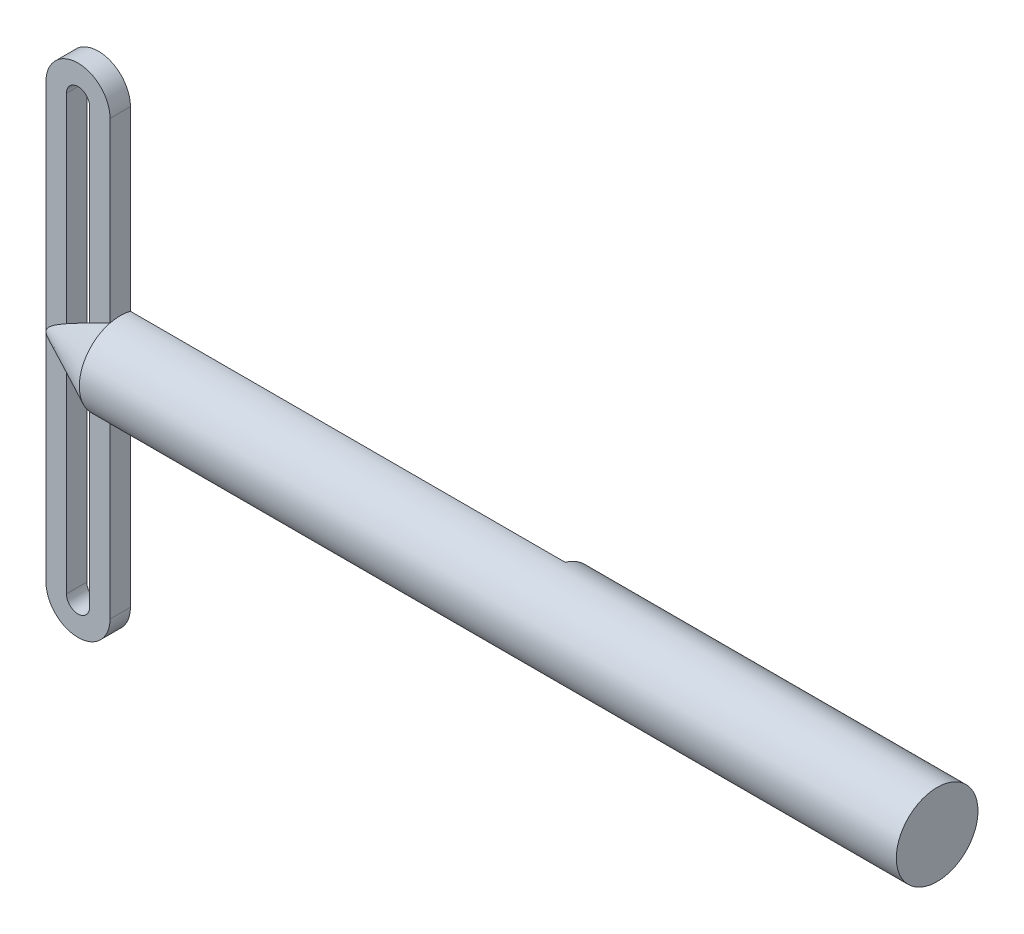
ISO-10303-21;
HEADER;
FILE_DESCRIPTION(('STEP AP214'),'2;1');
FILE_NAME('part.step','',(''),(''),'','','');
FILE_SCHEMA(('AUTOMOTIVE_DESIGN { 1 0 10303 214 1 1 1 1 }'));
ENDSEC;
DATA;
#1=APPLICATION_CONTEXT('core data for automotive mechanical design processes');
#2=APPLICATION_PROTOCOL_DEFINITION('international standard','automotive_design',2000,#1);
#3=PRODUCT_CONTEXT('',#1,'mechanical');
#4=PRODUCT('Part','Part','',(#3));
#5=PRODUCT_RELATED_PRODUCT_CATEGORY('part','',(#4));
#6=PRODUCT_DEFINITION_FORMATION('','',#4);
#7=PRODUCT_DEFINITION_CONTEXT('part definition',#1,'design');
#8=PRODUCT_DEFINITION('design','',#6,#7);
#9=PRODUCT_DEFINITION_SHAPE('','',#8);
#10=(LENGTH_UNIT() NAMED_UNIT(*) SI_UNIT(.MILLI.,.METRE.));
#11=(NAMED_UNIT(*) PLANE_ANGLE_UNIT() SI_UNIT($,.RADIAN.));
#12=(NAMED_UNIT(*) SI_UNIT($,.STERADIAN.) SOLID_ANGLE_UNIT());
#13=UNCERTAINTY_MEASURE_WITH_UNIT(LENGTH_MEASURE(1.E-05),#10,'distance_accuracy_value','');
#14=(GEOMETRIC_REPRESENTATION_CONTEXT(3) GLOBAL_UNCERTAINTY_ASSIGNED_CONTEXT((#13)) GLOBAL_UNIT_ASSIGNED_CONTEXT((#10,
#11,#12)) REPRESENTATION_CONTEXT('',''));
#15=CARTESIAN_POINT('',(0.,0.,0.));
#16=DIRECTION('',(0.,0.,1.));
#17=DIRECTION('',(1.,0.,0.));
#18=AXIS2_PLACEMENT_3D('',#15,#16,#17);
#19=CARTESIAN_POINT('',(0.,67.400163523,3.175));
#20=DIRECTION('',(0.,0.,1.));
#21=DIRECTION('',(1.,0.,0.));
#22=AXIS2_PLACEMENT_3D('',#19,#20,#21);
#23=PLANE('',#22);
#24=DIRECTION('',(0.,1.,0.));
#25=VECTOR('',#24,1.);
#26=CARTESIAN_POINT('',(9.951639355,67.400163523,3.175));
#27=LINE('',#26,#25);
#28=CARTESIAN_POINT('',(9.951639355,-67.400163523,3.175));
#29=VERTEX_POINT('',#28);
#30=CARTESIAN_POINT('',(9.95163935499999,-12.2967221242085,3.175));
#31=VERTEX_POINT('',#30);
#32=EDGE_CURVE('E253',#29,#31,#27,.T.);
#33=ORIENTED_EDGE('',*,*,#32,.T.);
#34=DIRECTION('',(1.,0.,0.));
#35=VECTOR('',#34,1.);
#36=CARTESIAN_POINT('',(-36.3251701197649,-12.2967221242086,3.175));
#37=LINE('',#36,#35);
#38=CARTESIAN_POINT('',(9.92856923282215,-12.2967221242086,3.175));
#39=VERTEX_POINT('',#38);
#40=EDGE_CURVE('E175',#39,#31,#37,.T.);
#41=ORIENTED_EDGE('',*,*,#40,.F.);
#42=CARTESIAN_POINT('',(9.92856923282215,-12.2967221242086,3.175));
#43=CARTESIAN_POINT('',(9.40021267329186,-12.0352635261606,3.175));
#44=CARTESIAN_POINT('',(8.87205462615573,-11.7734028603276,3.175));
#45=CARTESIAN_POINT('',(7.81624960187213,-11.248661261627,3.175));
#46=CARTESIAN_POINT('',(7.28860262171317,-10.9857803348176,3.175));
#47=CARTESIAN_POINT('',(6.23392632847116,-10.4587783977464,3.175));
#48=CARTESIAN_POINT('',(5.70689701677337,-10.1946573847101,3.175));
#49=CARTESIAN_POINT('',(4.65362985695553,-9.66483456339225,3.175));
#50=CARTESIAN_POINT('',(4.12739201357332,-9.39913274569466,3.175));
#51=CARTESIAN_POINT('',(3.60163935499997,-9.13247144941657,3.175));
#52=B_SPLINE_CURVE_WITH_KNOTS('',3,(#42,#43,#44,#45,#46,#47,#48,#49,#50,#51),.UNSPECIFIED.,.F.,
.F.,(4,2,2,2,4),(0.,1.76852838908944,3.53704629287363,5.30556815536591,7.07410056268999),.UNSPECIFIED.);
#53=CARTESIAN_POINT('',(3.601639355,-9.13247144941652,3.175));
#54=VERTEX_POINT('',#53);
#55=EDGE_CURVE('E322',#39,#54,#52,.T.);
#56=ORIENTED_EDGE('',*,*,#55,.T.);
#57=DIRECTION('',(0.,1.,0.));
#58=VECTOR('',#57,1.);
#59=CARTESIAN_POINT('',(3.601639355,67.400163523,3.175));
#60=LINE('',#59,#58);
#61=CARTESIAN_POINT('',(3.601639355,-67.400163523,3.175));
#62=VERTEX_POINT('',#61);
#63=EDGE_CURVE('E209',#62,#54,#60,.T.);
#64=ORIENTED_EDGE('',*,*,#63,.F.);
#65=CARTESIAN_POINT('',(0.,-67.400163523,3.175));
#66=DIRECTION('',(0.,0.,1.));
#67=DIRECTION('',(1.,0.,0.));
#68=AXIS2_PLACEMENT_3D('',#65,#66,#67);
#69=CIRCLE('',#68,3.601639355);
#70=CARTESIAN_POINT('',(-3.60163935499996,-67.400163523,3.175));
#71=VERTEX_POINT('',#70);
#72=EDGE_CURVE('E204',#71,#62,#69,.T.);
#73=ORIENTED_EDGE('',*,*,#72,.F.);
#74=DIRECTION('',(0.,-1.,0.));
#75=VECTOR('',#74,1.);
#76=CARTESIAN_POINT('',(-3.601639355,67.400163523,3.175));
#77=LINE('',#76,#75);
#78=CARTESIAN_POINT('',(-3.601639355,-5.34561174977097,3.175));
#79=VERTEX_POINT('',#78);
#80=EDGE_CURVE('E59',#79,#71,#77,.T.);
#81=ORIENTED_EDGE('',*,*,#80,.F.);
#82=CARTESIAN_POINT('',(-3.601639355,-5.34561174977095,3.175));
#83=CARTESIAN_POINT('',(-3.82669201501389,-5.22016696609639,3.175));
#84=CARTESIAN_POINT('',(-4.05128662577208,-5.09388802547673,3.175));
#85=CARTESIAN_POINT('',(-4.49928147642298,-4.83915140790419,3.175));
#86=CARTESIAN_POINT('',(-4.72268152739645,-4.71069339899715,3.175));
#87=CARTESIAN_POINT('',(-5.16746991312185,-4.45140029709294,3.175));
#88=CARTESIAN_POINT('',(-5.38886149769996,-4.32057079084367,3.175));
#89=CARTESIAN_POINT('',(-5.82962534093046,-4.05557262582838,3.175));
#90=CARTESIAN_POINT('',(-6.04899773284873,-3.92140418962666,3.175));
#91=CARTESIAN_POINT('',(-6.40849446887534,-3.69658398689418,3.175));
#92=CARTESIAN_POINT('',(-6.54940468834875,-3.60718978580888,3.175));
#93=CARTESIAN_POINT('',(-6.82980186236323,-3.42619532732211,3.175));
#94=CARTESIAN_POINT('',(-6.96928883785182,-3.33459510245612,3.175));
#95=CARTESIAN_POINT('',(-7.24681412852673,-3.14847406397823,3.175));
#96=CARTESIAN_POINT('',(-7.38484792293182,-3.0539464900683,3.175));
#97=CARTESIAN_POINT('',(-7.65855764448422,-2.86155741737834,3.175));
#98=CARTESIAN_POINT('',(-7.79423385772066,-2.76369632744292,3.175));
#99=CARTESIAN_POINT('',(-8.05675922606516,-2.5679993955025,3.175));
#100=CARTESIAN_POINT('',(-8.18373854531201,-2.47033899861367,3.175));
#101=CARTESIAN_POINT('',(-8.43375296966406,-2.27010400283209,3.175));
#102=CARTESIAN_POINT('',(-8.55678887223861,-2.16753040812594,3.175));
#103=CARTESIAN_POINT('',(-8.79696417788006,-1.95624657333157,3.175));
#104=CARTESIAN_POINT('',(-8.91411789958859,-1.84755275315074,3.175));
#105=CARTESIAN_POINT('',(-9.14001633079981,-1.62183336182119,3.175));
#106=CARTESIAN_POINT('',(-9.24877129945036,-1.50481830200021,3.175));
#107=CARTESIAN_POINT('',(-9.43138685498455,-1.28560591664424,3.175));
#108=CARTESIAN_POINT('',(-9.50775682533464,-1.18552741743335,3.175));
#109=CARTESIAN_POINT('',(-9.64813434231815,-0.97686619384379,3.175));
#110=CARTESIAN_POINT('',(-9.71215197693904,-0.868290511746388,3.175));
#111=CARTESIAN_POINT('',(-9.80947638683184,-0.666734265250446,3.175));
#112=CARTESIAN_POINT('',(-9.84643905856201,-0.575552605051904,3.175));
#113=CARTESIAN_POINT('',(-9.90498299551209,-0.388457123413757,3.175));
#114=CARTESIAN_POINT('',(-9.92661706698148,-0.292560777155648,3.175));
#115=CARTESIAN_POINT('',(-9.94324191511999,-0.163178203739718,3.175));
#116=CARTESIAN_POINT('',(-9.94638186696771,-0.130642255531356,3.175));
#117=CARTESIAN_POINT('',(-9.95058162815478,-0.0654090102814208,3.175));
#118=CARTESIAN_POINT('',(-9.95163967608958,-0.0327116000580266,3.175));
#119=CARTESIAN_POINT('',(-9.9516393549999,0.,3.175));
#120=B_SPLINE_CURVE_WITH_KNOTS('',3,(#82,#83,#84,#85,#86,#87,#88,#89,#90,#91,#92,#93,#94,#95,
#96,#97,#98,#99,#100,#101,#102,#103,#104,#105,#106,#107,#108,#109,#110,#111,#112,#113,#114,#115,
#116,#117,#118,#119),.UNSPECIFIED.,.F.,.F.,(4,2,2,2,2,2,2,2,2,2,2,2,2,2,2,2,2,2,4),(0.,
0.772966576870776,1.54605198238181,2.31750639152237,3.08890951455086,3.5895161803204,
4.09011546742119,4.59197262408078,5.09376844969529,5.57425268810969,6.05463913807293,
6.53379306822147,7.01235213284782,7.3894420833325,7.766222753768,8.06040791985219,
8.35357463956639,8.4515820391788,8.54967232281827),.UNSPECIFIED.);
#121=CARTESIAN_POINT('',(-9.95163935499998,0.,3.175));
#122=VERTEX_POINT('',#121);
#123=EDGE_CURVE('E330',#79,#122,#120,.T.);
#124=ORIENTED_EDGE('',*,*,#123,.T.);
#125=DIRECTION('',(0.,-1.,0.));
#126=VECTOR('',#125,1.);
#127=CARTESIAN_POINT('',(-9.951639355,67.400163523,3.175));
#128=LINE('',#127,#126);
#129=CARTESIAN_POINT('',(-9.95163935499994,-67.4001635229999,3.175));
#130=VERTEX_POINT('',#129);
#131=EDGE_CURVE('E244',#122,#130,#128,.T.);
#132=ORIENTED_EDGE('',*,*,#131,.T.);
#133=CARTESIAN_POINT('',(0.,-67.400163523,3.175));
#134=DIRECTION('',(0.,0.,1.));
#135=DIRECTION('',(1.,0.,0.));
#136=AXIS2_PLACEMENT_3D('',#133,#134,#135);
#137=CIRCLE('',#136,9.95163935499998);
#138=EDGE_CURVE('E249',#130,#29,#137,.T.);
#139=ORIENTED_EDGE('',*,*,#138,.T.);
#140=EDGE_LOOP('',(#33,#41,#56,#64,#73,#81,#124,#132,#139));
#141=FACE_BOUND('',#140,.T.);
#142=ADVANCED_FACE('F37',(#141),#23,.T.);
#143=CARTESIAN_POINT('',(-9.951639355,67.400163523,3.175));
#144=VERTEX_POINT('',#143);
#145=EDGE_CURVE('E246',#144,#122,#128,.T.);
#146=ORIENTED_EDGE('',*,*,#145,.T.);
#147=CARTESIAN_POINT('',(-9.95163935499998,0.,3.17499999999996));
#148=CARTESIAN_POINT('',(-9.95169448239353,0.0562897077029268,3.17499999999998));
#149=CARTESIAN_POINT('',(-9.9485168782644,0.112541193673862,3.175));
#150=CARTESIAN_POINT('',(-9.93613655770212,0.22422483855214,3.175));
#151=CARTESIAN_POINT('',(-9.92695065613406,0.279658843846916,3.175));
#152=CARTESIAN_POINT('',(-9.90327086467274,0.387998264955036,3.175));
#153=CARTESIAN_POINT('',(-9.88890663074982,0.44093249122138,3.175));
#154=CARTESIAN_POINT('',(-9.85547023727371,0.545315660559682,3.175));
#155=CARTESIAN_POINT('',(-9.83639463535345,0.596763486753073,3.175));
#156=CARTESIAN_POINT('',(-9.78653768012022,0.716333875766968,3.175));
#157=CARTESIAN_POINT('',(-9.75402063679816,0.78373086546049,3.175));
#158=CARTESIAN_POINT('',(-9.68304697399354,0.915299864193731,3.175));
#159=CARTESIAN_POINT('',(-9.64458770488763,0.979470417572486,3.175));
#160=CARTESIAN_POINT('',(-9.56258642078678,1.10545301857098,3.175));
#161=CARTESIAN_POINT('',(-9.51899332397768,1.16723151339738,3.175));
#162=CARTESIAN_POINT('',(-9.42811876761771,1.28796187607611,3.175));
#163=CARTESIAN_POINT('',(-9.380838212226,1.346914431156,3.175));
#164=CARTESIAN_POINT('',(-9.25638608727381,1.49430604622022,3.175));
#165=CARTESIAN_POINT('',(-9.17715634733817,1.58100261329657,3.175));
#166=CARTESIAN_POINT('',(-9.01370950585463,1.74959256881134,3.175));
#167=CARTESIAN_POINT('',(-8.92948923487021,1.83148283766864,3.175));
#168=CARTESIAN_POINT('',(-8.75724236839067,1.99148943500434,3.175));
#169=CARTESIAN_POINT('',(-8.6692084680823,2.06959785369145,3.175));
#170=CARTESIAN_POINT('',(-8.49037708011649,2.22259758983146,3.175));
#171=CARTESIAN_POINT('',(-8.39957909591575,2.29748832335909,3.175));
#172=CARTESIAN_POINT('',(-8.21536876209012,2.44499165159033,3.175));
#173=CARTESIAN_POINT('',(-8.12194511650669,2.51759008643868,3.175));
#174=CARTESIAN_POINT('',(-7.9333891386111,2.66053778568369,3.175));
#175=CARTESIAN_POINT('',(-7.83825668953733,2.73088689546512,3.175));
#176=CARTESIAN_POINT('',(-7.55107354014842,2.93891756136008,3.175));
#177=CARTESIAN_POINT('',(-7.35698235857416,3.0737826520781,3.175));
#178=CARTESIAN_POINT('',(-7.01559064201126,3.30397313731916,3.175));
#179=CARTESIAN_POINT('',(-6.8691144503241,3.40053564897337,3.175));
#180=CARTESIAN_POINT('',(-6.57455318409859,3.591184250259,3.175));
#181=CARTESIAN_POINT('',(-6.42646806217799,3.68527026667797,3.175));
#182=CARTESIAN_POINT('',(-5.98014265196966,3.9646045208739,3.175));
#183=CARTESIAN_POINT('',(-5.68000372791445,4.14681508863309,3.175));
#184=CARTESIAN_POINT('',(-5.08455846215241,4.50067403467468,3.175));
#185=CARTESIAN_POINT('',(-4.789342066533,4.67247485972521,3.175));
#186=CARTESIAN_POINT('',(-4.34494266510378,4.92707982104348,3.175));
#187=CARTESIAN_POINT('',(-4.19662046560182,5.01139135151681,3.175));
#188=CARTESIAN_POINT('',(-3.89948226560669,5.17913221151051,3.175));
#189=CARTESIAN_POINT('',(-3.7506662762341,5.26256156072356,3.175));
#190=CARTESIAN_POINT('',(-3.60163935499999,5.34561174977097,3.175));
#191=B_SPLINE_CURVE_WITH_KNOTS('',3,(#147,#148,#149,#150,#151,#152,#153,#154,#155,#156,#157,
#158,#159,#160,#161,#162,#163,#164,#165,#166,#167,#168,#169,#170,#171,#172,#173,#174,#175,#176,
#177,#178,#179,#180,#181,#182,#183,#184,#185,#186,#187,#188,#189,#190),.UNSPECIFIED.,.F.,.F.,(4,
2,2,2,2,2,2,2,2,2,2,2,2,2,2,2,2,2,2,2,2,4),(0.,0.168718617034621,0.336967065666885,
0.501266209773684,0.665685756244204,0.889783823701974,1.1139821058399,1.34063732131816,
1.56723713496434,1.91927537358042,2.2715396355902,2.62451137579148,2.97754690284159,
3.33245145376667,3.6873803480795,4.39626707113989,4.92256912205009,5.44888671455263,
6.50213901563629,7.52680364456953,8.03863228465319,8.55044947511146),.UNSPECIFIED.);
#192=CARTESIAN_POINT('',(-3.601639355,5.34561174977097,3.175));
#193=VERTEX_POINT('',#192);
#194=EDGE_CURVE('E52',#122,#193,#191,.T.);
#195=ORIENTED_EDGE('',*,*,#194,.T.);
#196=CARTESIAN_POINT('',(-3.601639355,67.400163523,3.175));
#197=VERTEX_POINT('',#196);
#198=EDGE_CURVE('E67',#197,#193,#77,.T.);
#199=ORIENTED_EDGE('',*,*,#198,.F.);
#200=CARTESIAN_POINT('',(0.,67.400163523,3.175));
#201=DIRECTION('',(0.,0.,1.));
#202=DIRECTION('',(1.,0.,0.));
#203=AXIS2_PLACEMENT_3D('',#200,#201,#202);
#204=CIRCLE('',#203,3.601639355);
#205=CARTESIAN_POINT('',(3.601639355,67.400163523,3.175));
#206=VERTEX_POINT('',#205);
#207=EDGE_CURVE('E198',#206,#197,#204,.T.);
#208=ORIENTED_EDGE('',*,*,#207,.F.);
#209=CARTESIAN_POINT('',(3.601639355,9.13247144941652,3.175));
#210=VERTEX_POINT('',#209);
#211=EDGE_CURVE('E208',#210,#206,#60,.T.);
#212=ORIENTED_EDGE('',*,*,#211,.F.);
#213=CARTESIAN_POINT('',(3.601639355,9.13247144941651,3.175));
#214=CARTESIAN_POINT('',(4.12739201357333,9.39913274569463,3.175));
#215=CARTESIAN_POINT('',(4.65362985695553,9.66483456339224,3.175));
#216=CARTESIAN_POINT('',(5.70689701677337,10.1946573847101,3.175));
#217=CARTESIAN_POINT('',(6.23392632847116,10.4587783977464,3.175));
#218=CARTESIAN_POINT('',(7.28860262171317,10.9857803348176,3.175));
#219=CARTESIAN_POINT('',(7.81624960187213,11.248661261627,3.175));
#220=CARTESIAN_POINT('',(8.87205462615573,11.7734028603276,3.175));
#221=CARTESIAN_POINT('',(9.40021267329185,12.0352635261607,3.175));
#222=CARTESIAN_POINT('',(9.92856923282214,12.2967221242086,3.175));
#223=B_SPLINE_CURVE_WITH_KNOTS('',3,(#213,#214,#215,#216,#217,#218,#219,#220,#221,#222),
.UNSPECIFIED.,.F.,.F.,(4,2,2,2,4),(0.,1.76853240732408,3.53705426981637,5.30557217360056,
7.07410056268999),.UNSPECIFIED.);
#224=CARTESIAN_POINT('',(9.92856923282215,12.2967221242085,3.175));
#225=VERTEX_POINT('',#224);
#226=EDGE_CURVE('E11',#210,#225,#223,.T.);
#227=ORIENTED_EDGE('',*,*,#226,.T.);
#228=DIRECTION('',(1.,0.,0.));
#229=VECTOR('',#228,1.);
#230=CARTESIAN_POINT('',(-36.3251701197649,12.2967221242085,3.175));
#231=LINE('',#230,#229);
#232=CARTESIAN_POINT('',(9.951639355,12.2967221242085,3.175));
#233=VERTEX_POINT('',#232);
#234=EDGE_CURVE('E178',#225,#233,#231,.T.);
#235=ORIENTED_EDGE('',*,*,#234,.T.);
#236=CARTESIAN_POINT('',(9.951639355,67.400163523,3.175));
#237=VERTEX_POINT('',#236);
#238=EDGE_CURVE('E252',#233,#237,#27,.T.);
#239=ORIENTED_EDGE('',*,*,#238,.T.);
#240=CARTESIAN_POINT('',(0.,67.400163523,3.175));
#241=DIRECTION('',(0.,0.,1.));
#242=DIRECTION('',(1.,0.,0.));
#243=AXIS2_PLACEMENT_3D('',#240,#241,#242);
#244=CIRCLE('',#243,9.951639355);
#245=EDGE_CURVE('E240',#237,#144,#244,.T.);
#246=ORIENTED_EDGE('',*,*,#245,.T.);
#247=EDGE_LOOP('',(#146,#195,#199,#208,#212,#227,#235,#239,#246));
#248=FACE_BOUND('',#247,.T.);
#249=ADVANCED_FACE('F339',(#248),#23,.T.);
#250=CARTESIAN_POINT('',(0.,67.400163523,-3.175));
#251=DIRECTION('',(0.,0.,1.));
#252=DIRECTION('',(1.,0.,0.));
#253=AXIS2_PLACEMENT_3D('',#250,#251,#252);
#254=PLANE('',#253);
#255=DIRECTION('',(0.,1.,0.));
#256=VECTOR('',#255,1.);
#257=CARTESIAN_POINT('',(9.951639355,67.400163523,-3.175));
#258=LINE('',#257,#256);
#259=CARTESIAN_POINT('',(9.95163935499999,12.2967221242086,-3.17499999999999));
#260=VERTEX_POINT('',#259);
#261=CARTESIAN_POINT('',(9.951639355,67.400163523,-3.175));
#262=VERTEX_POINT('',#261);
#263=EDGE_CURVE('E169',#260,#262,#258,.T.);
#264=ORIENTED_EDGE('',*,*,#263,.F.);
#265=DIRECTION('',(-1.,0.,0.));
#266=VECTOR('',#265,1.);
#267=CARTESIAN_POINT('',(263.951639355,12.2967221242086,-3.17499999999999));
#268=LINE('',#267,#266);
#269=CARTESIAN_POINT('',(145.136629866112,12.2967221242086,-3.17499999999998));
#270=VERTEX_POINT('',#269);
#271=EDGE_CURVE('E155',#270,#260,#268,.T.);
#272=ORIENTED_EDGE('',*,*,#271,.F.);
#273=CARTESIAN_POINT('',(-9.95163935499998,0.,-3.17499999999998));
#274=DIRECTION('',(0.,0.,1.));
#275=DIRECTION('',(0.,-1.,0.));
#276=AXIS2_PLACEMENT_3D('',#273,#274,#275);
#277=CIRCLE('',#276,155.575);
#278=CARTESIAN_POINT('',(145.136629866112,-12.2967221242086,-3.17499999999998));
#279=VERTEX_POINT('',#278);
#280=EDGE_CURVE('E167',#279,#270,#277,.T.);
#281=ORIENTED_EDGE('',*,*,#280,.F.);
#282=DIRECTION('',(-1.,0.,0.));
#283=VECTOR('',#282,1.);
#284=CARTESIAN_POINT('',(263.951639355,-12.2967221242086,-3.17499999999999));
#285=LINE('',#284,#283);
#286=CARTESIAN_POINT('',(9.95163935499999,-12.2967221242086,-3.17499999999999));
#287=VERTEX_POINT('',#286);
#288=EDGE_CURVE('E158',#287,#279,#285,.F.);
#289=ORIENTED_EDGE('',*,*,#288,.F.);
#290=CARTESIAN_POINT('',(9.951639355,-67.400163523,-3.175));
#291=VERTEX_POINT('',#290);
#292=EDGE_CURVE('E245',#291,#287,#258,.T.);
#293=ORIENTED_EDGE('',*,*,#292,.F.);
#294=CARTESIAN_POINT('',(0.,-67.400163523,-3.175));
#295=DIRECTION('',(0.,0.,1.));
#296=DIRECTION('',(1.,0.,0.));
#297=AXIS2_PLACEMENT_3D('',#294,#295,#296);
#298=CIRCLE('',#297,9.95163935499998);
#299=CARTESIAN_POINT('',(-9.95163935499994,-67.4001635229999,-3.175));
#300=VERTEX_POINT('',#299);
#301=EDGE_CURVE('E264',#300,#291,#298,.T.);
#302=ORIENTED_EDGE('',*,*,#301,.F.);
#303=DIRECTION('',(0.,-1.,0.));
#304=VECTOR('',#303,1.);
#305=CARTESIAN_POINT('',(-9.951639355,67.400163523,-3.175));
#306=LINE('',#305,#304);
#307=CARTESIAN_POINT('',(-9.951639355,67.400163523,-3.175));
#308=VERTEX_POINT('',#307);
#309=EDGE_CURVE('E261',#308,#300,#306,.T.);
#310=ORIENTED_EDGE('',*,*,#309,.F.);
#311=CARTESIAN_POINT('',(0.,67.400163523,-3.175));
#312=DIRECTION('',(0.,0.,1.));
#313=DIRECTION('',(1.,0.,0.));
#314=AXIS2_PLACEMENT_3D('',#311,#312,#313);
#315=CIRCLE('',#314,9.951639355);
#316=EDGE_CURVE('E239',#262,#308,#315,.T.);
#317=ORIENTED_EDGE('',*,*,#316,.F.);
#318=EDGE_LOOP('',(#264,#272,#281,#289,#293,#302,#310,#317));
#319=FACE_BOUND('',#318,.T.);
#320=DIRECTION('',(0.,-1.,0.));
#321=VECTOR('',#320,1.);
#322=CARTESIAN_POINT('',(-3.601639355,67.400163523,-3.175));
#323=LINE('',#322,#321);
#324=CARTESIAN_POINT('',(-3.601639355,67.400163523,-3.175));
#325=VERTEX_POINT('',#324);
#326=CARTESIAN_POINT('',(-3.60163935499996,-67.400163523,-3.175));
#327=VERTEX_POINT('',#326);
#328=EDGE_CURVE('E216',#325,#327,#323,.T.);
#329=ORIENTED_EDGE('',*,*,#328,.T.);
#330=CARTESIAN_POINT('',(0.,-67.400163523,-3.175));
#331=DIRECTION('',(0.,0.,1.));
#332=DIRECTION('',(1.,0.,0.));
#333=AXIS2_PLACEMENT_3D('',#330,#331,#332);
#334=CIRCLE('',#333,3.601639355);
#335=CARTESIAN_POINT('',(3.601639355,-67.400163523,-3.175));
#336=VERTEX_POINT('',#335);
#337=EDGE_CURVE('E219',#327,#336,#334,.T.);
#338=ORIENTED_EDGE('',*,*,#337,.T.);
#339=DIRECTION('',(0.,1.,0.));
#340=VECTOR('',#339,1.);
#341=CARTESIAN_POINT('',(3.601639355,67.400163523,-3.175));
#342=LINE('',#341,#340);
#343=CARTESIAN_POINT('',(3.601639355,67.400163523,-3.175));
#344=VERTEX_POINT('',#343);
#345=EDGE_CURVE('E201',#336,#344,#342,.T.);
#346=ORIENTED_EDGE('',*,*,#345,.T.);
#347=CARTESIAN_POINT('',(0.,67.400163523,-3.175));
#348=DIRECTION('',(0.,0.,1.));
#349=DIRECTION('',(1.,0.,0.));
#350=AXIS2_PLACEMENT_3D('',#347,#348,#349);
#351=CIRCLE('',#350,3.601639355);
#352=EDGE_CURVE('E195',#344,#325,#351,.T.);
#353=ORIENTED_EDGE('',*,*,#352,.T.);
#354=EDGE_LOOP('',(#329,#338,#346,#353));
#355=FACE_BOUND('',#354,.T.);
#356=ADVANCED_FACE('F165',(#319,#355),#254,.F.);
#357=CARTESIAN_POINT('',(9.951639355,67.400163523,3.175));
#358=DIRECTION('',(-1.,0.,0.));
#359=DIRECTION('',(0.,0.,1.));
#360=AXIS2_PLACEMENT_3D('',#357,#358,#359);
#361=PLANE('',#360);
#362=CARTESIAN_POINT('',(9.95163935499999,0.,0.));
#363=DIRECTION('',(-1.,0.,0.));
#364=DIRECTION('',(0.,0.,1.));
#365=AXIS2_PLACEMENT_3D('',#362,#363,#364);
#366=CIRCLE('',#365,12.7);
#367=EDGE_CURVE('E285',#31,#287,#366,.F.);
#368=ORIENTED_EDGE('',*,*,#367,.F.);
#369=ORIENTED_EDGE('',*,*,#32,.F.);
#370=DIRECTION('',(0.,0.,-1.));
#371=VECTOR('',#370,1.);
#372=CARTESIAN_POINT('',(9.951639355,-67.400163523,3.175));
#373=LINE('',#372,#371);
#374=EDGE_CURVE('E273',#29,#291,#373,.T.);
#375=ORIENTED_EDGE('',*,*,#374,.T.);
#376=ORIENTED_EDGE('',*,*,#292,.T.);
#377=EDGE_LOOP('',(#368,#369,#375,#376));
#378=FACE_BOUND('',#377,.T.);
#379=ADVANCED_FACE('F375',(#378),#361,.F.);
#380=CARTESIAN_POINT('',(0.,67.400163523,3.175));
#381=DIRECTION('',(0.,0.,-1.));
#382=DIRECTION('',(-1.,0.,0.));
#383=AXIS2_PLACEMENT_3D('',#380,#381,#382);
#384=CYLINDRICAL_SURFACE('',#383,9.951639355);
#385=ORIENTED_EDGE('',*,*,#316,.T.);
#386=DIRECTION('',(0.,0.,-1.));
#387=VECTOR('',#386,1.);
#388=CARTESIAN_POINT('',(-9.951639355,67.400163523,3.175));
#389=LINE('',#388,#387);
#390=EDGE_CURVE('E281',#144,#308,#389,.T.);
#391=ORIENTED_EDGE('',*,*,#390,.F.);
#392=ORIENTED_EDGE('',*,*,#245,.F.);
#393=DIRECTION('',(0.,0.,-1.));
#394=VECTOR('',#393,1.);
#395=CARTESIAN_POINT('',(9.951639355,67.400163523,3.175));
#396=LINE('',#395,#394);
#397=EDGE_CURVE('E257',#237,#262,#396,.T.);
#398=ORIENTED_EDGE('',*,*,#397,.T.);
#399=EDGE_LOOP('',(#385,#391,#392,#398));
#400=FACE_BOUND('',#399,.T.);
#401=ADVANCED_FACE('F385',(#400),#384,.T.);
#402=CARTESIAN_POINT('',(-9.951639355,67.400163523,3.175));
#403=DIRECTION('',(1.,0.,0.));
#404=DIRECTION('',(0.,1.,0.));
#405=AXIS2_PLACEMENT_3D('',#402,#403,#404);
#406=PLANE('',#405);
#407=ORIENTED_EDGE('',*,*,#131,.F.);
#408=ORIENTED_EDGE('',*,*,#145,.F.);
#409=ORIENTED_EDGE('',*,*,#390,.T.);
#410=ORIENTED_EDGE('',*,*,#309,.T.);
#411=DIRECTION('',(0.,0.,-1.));
#412=VECTOR('',#411,1.);
#413=CARTESIAN_POINT('',(-9.95163935499994,-67.4001635229999,3.175));
#414=LINE('',#413,#412);
#415=EDGE_CURVE('E277',#130,#300,#414,.T.);
#416=ORIENTED_EDGE('',*,*,#415,.F.);
#417=EDGE_LOOP('',(#407,#408,#409,#410,#416));
#418=FACE_BOUND('',#417,.T.);
#419=ADVANCED_FACE('F381',(#418),#406,.F.);
#420=CARTESIAN_POINT('',(0.,-67.400163523,3.175));
#421=DIRECTION('',(0.,0.,-1.));
#422=DIRECTION('',(-1.,0.,0.));
#423=AXIS2_PLACEMENT_3D('',#420,#421,#422);
#424=CYLINDRICAL_SURFACE('',#423,9.95163935499998);
#425=ORIENTED_EDGE('',*,*,#301,.T.);
#426=ORIENTED_EDGE('',*,*,#374,.F.);
#427=ORIENTED_EDGE('',*,*,#138,.F.);
#428=ORIENTED_EDGE('',*,*,#415,.T.);
#429=EDGE_LOOP('',(#425,#426,#427,#428));
#430=FACE_BOUND('',#429,.T.);
#431=ADVANCED_FACE('F379',(#430),#424,.T.);
#432=CARTESIAN_POINT('',(9.951639355,0.,0.));
#433=DIRECTION('',(1.,0.,0.));
#434=DIRECTION('',(0.,0.,-1.));
#435=AXIS2_PLACEMENT_3D('',#432,#433,#434);
#436=CIRCLE('',#435,12.7);
#437=EDGE_CURVE('E190',#260,#233,#436,.T.);
#438=ORIENTED_EDGE('',*,*,#437,.F.);
#439=ORIENTED_EDGE('',*,*,#263,.T.);
#440=ORIENTED_EDGE('',*,*,#397,.F.);
#441=ORIENTED_EDGE('',*,*,#238,.F.);
#442=EDGE_LOOP('',(#438,#439,#440,#441));
#443=FACE_BOUND('',#442,.T.);
#444=ADVANCED_FACE('F389',(#443),#361,.F.);
#445=CARTESIAN_POINT('',(0.,67.400163523,3.175));
#446=DIRECTION('',(0.,0.,-1.));
#447=DIRECTION('',(-1.,0.,0.));
#448=AXIS2_PLACEMENT_3D('',#445,#446,#447);
#449=CYLINDRICAL_SURFACE('',#448,3.601639355);
#450=ORIENTED_EDGE('',*,*,#352,.F.);
#451=DIRECTION('',(0.,0.,-1.));
#452=VECTOR('',#451,1.);
#453=CARTESIAN_POINT('',(3.601639355,67.400163523,3.175));
#454=LINE('',#453,#452);
#455=EDGE_CURVE('E212',#206,#344,#454,.T.);
#456=ORIENTED_EDGE('',*,*,#455,.F.);
#457=ORIENTED_EDGE('',*,*,#207,.T.);
#458=DIRECTION('',(0.,0.,-1.));
#459=VECTOR('',#458,1.);
#460=CARTESIAN_POINT('',(-3.601639355,67.400163523,3.175));
#461=LINE('',#460,#459);
#462=EDGE_CURVE('E235',#197,#325,#461,.T.);
#463=ORIENTED_EDGE('',*,*,#462,.T.);
#464=EDGE_LOOP('',(#450,#456,#457,#463));
#465=FACE_BOUND('',#464,.T.);
#466=ADVANCED_FACE('F340',(#465),#449,.F.);
#467=CARTESIAN_POINT('',(-3.601639355,67.400163523,3.175));
#468=DIRECTION('',(1.,0.,0.));
#469=DIRECTION('',(0.,0.,-1.));
#470=AXIS2_PLACEMENT_3D('',#467,#468,#469);
#471=PLANE('',#470);
#472=ORIENTED_EDGE('',*,*,#328,.F.);
#473=ORIENTED_EDGE('',*,*,#462,.F.);
#474=ORIENTED_EDGE('',*,*,#198,.T.);
#475=DIRECTION('',(0.,-1.,0.));
#476=VECTOR('',#475,1.);
#477=CARTESIAN_POINT('',(-3.601639355,67.400163523,3.175));
#478=LINE('',#477,#476);
#479=EDGE_CURVE('E187',#193,#79,#478,.T.);
#480=ORIENTED_EDGE('',*,*,#479,.T.);
#481=ORIENTED_EDGE('',*,*,#80,.T.);
#482=DIRECTION('',(0.,0.,-1.));
#483=VECTOR('',#482,1.);
#484=CARTESIAN_POINT('',(-3.60163935499996,-67.400163523,3.175));
#485=LINE('',#484,#483);
#486=EDGE_CURVE('E231',#71,#327,#485,.T.);
#487=ORIENTED_EDGE('',*,*,#486,.T.);
#488=EDGE_LOOP('',(#472,#473,#474,#480,#481,#487));
#489=FACE_BOUND('',#488,.T.);
#490=ADVANCED_FACE('F394',(#489),#471,.T.);
#491=CARTESIAN_POINT('',(0.,-67.400163523,3.175));
#492=DIRECTION('',(0.,0.,-1.));
#493=DIRECTION('',(-1.,0.,0.));
#494=AXIS2_PLACEMENT_3D('',#491,#492,#493);
#495=CYLINDRICAL_SURFACE('',#494,3.601639355);
#496=ORIENTED_EDGE('',*,*,#337,.F.);
#497=ORIENTED_EDGE('',*,*,#486,.F.);
#498=ORIENTED_EDGE('',*,*,#72,.T.);
#499=DIRECTION('',(0.,0.,-1.));
#500=VECTOR('',#499,1.);
#501=CARTESIAN_POINT('',(3.601639355,-67.400163523,3.175));
#502=LINE('',#501,#500);
#503=EDGE_CURVE('E228',#62,#336,#502,.T.);
#504=ORIENTED_EDGE('',*,*,#503,.T.);
#505=EDGE_LOOP('',(#496,#497,#498,#504));
#506=FACE_BOUND('',#505,.T.);
#507=ADVANCED_FACE('F397',(#506),#495,.F.);
#508=CARTESIAN_POINT('',(3.601639355,67.400163523,3.175));
#509=DIRECTION('',(-1.,0.,0.));
#510=DIRECTION('',(0.,0.,1.));
#511=AXIS2_PLACEMENT_3D('',#508,#509,#510);
#512=PLANE('',#511);
#513=ORIENTED_EDGE('',*,*,#345,.F.);
#514=ORIENTED_EDGE('',*,*,#503,.F.);
#515=ORIENTED_EDGE('',*,*,#63,.T.);
#516=DIRECTION('',(0.,1.,0.));
#517=VECTOR('',#516,1.);
#518=CARTESIAN_POINT('',(3.601639355,67.400163523,3.175));
#519=LINE('',#518,#517);
#520=EDGE_CURVE('E183',#54,#210,#519,.T.);
#521=ORIENTED_EDGE('',*,*,#520,.T.);
#522=ORIENTED_EDGE('',*,*,#211,.T.);
#523=ORIENTED_EDGE('',*,*,#455,.T.);
#524=EDGE_LOOP('',(#513,#514,#515,#521,#522,#523));
#525=FACE_BOUND('',#524,.T.);
#526=ADVANCED_FACE('F400',(#525),#512,.T.);
#527=CARTESIAN_POINT('',(263.951639355,0.,0.));
#528=DIRECTION('',(-1.,0.,0.));
#529=DIRECTION('',(0.,0.,1.));
#530=AXIS2_PLACEMENT_3D('',#527,#528,#529);
#531=CYLINDRICAL_SURFACE('',#530,12.7);
#532=CARTESIAN_POINT('',(263.951639355,0.,0.));
#533=DIRECTION('',(1.,0.,0.));
#534=DIRECTION('',(0.,0.,-1.));
#535=AXIS2_PLACEMENT_3D('',#532,#533,#534);
#536=CIRCLE('',#535,12.7);
#537=CARTESIAN_POINT('',(263.951639355,0.,-12.7));
#538=VERTEX_POINT('',#537);
#539=EDGE_CURVE('E191',#538,#538,#536,.T.);
#540=ORIENTED_EDGE('',*,*,#539,.F.);
#541=EDGE_LOOP('',(#540));
#542=FACE_BOUND('',#541,.T.);
#543=ORIENTED_EDGE('',*,*,#234,.F.);
#544=CARTESIAN_POINT('',(9.92856923282215,0.,0.));
#545=DIRECTION('',(1.,0.,0.));
#546=DIRECTION('',(0.,0.,-1.));
#547=AXIS2_PLACEMENT_3D('',#544,#545,#546);
#548=CIRCLE('',#547,12.7);
#549=EDGE_CURVE('E171',#225,#39,#548,.T.);
#550=ORIENTED_EDGE('',*,*,#549,.T.);
#551=ORIENTED_EDGE('',*,*,#40,.T.);
#552=ORIENTED_EDGE('',*,*,#367,.T.);
#553=ORIENTED_EDGE('',*,*,#288,.T.);
#554=CARTESIAN_POINT('',(145.136629866112,-12.2967221242086,-3.17499999999998));
#555=CARTESIAN_POINT('',(145.143700722918,-12.2074553101836,-3.52088294221486));
#556=CARTESIAN_POINT('',(145.151870107227,-12.1035302244786,-3.86295046349283));
#557=CARTESIAN_POINT('',(145.170128431147,-11.8672823680729,-4.5370580893211));
#558=CARTESIAN_POINT('',(145.180217246713,-11.734961432405,-4.86909884025322));
#559=CARTESIAN_POINT('',(145.202029497152,-11.4429417104411,-5.52055013682872));
#560=CARTESIAN_POINT('',(145.213751664285,-11.2832641353853,-5.83997023364029));
#561=CARTESIAN_POINT('',(145.238499613252,-10.9376158244349,-6.46419547605116));
#562=CARTESIAN_POINT('',(145.251525385291,-10.7516452861081,-6.76900073144463));
#563=CARTESIAN_POINT('',(145.278516750048,-10.3546525635221,-7.36196495057499));
#564=CARTESIAN_POINT('',(145.292482710189,-10.1436205603999,-7.65011732369042));
#565=CARTESIAN_POINT('',(145.320953436816,-9.69806017572072,-8.2076159810999));
#566=CARTESIAN_POINT('',(145.335458203943,-9.4635317662038,-8.47696224301473));
#567=CARTESIAN_POINT('',(145.364593352691,-8.97267519956084,-8.99490865619621));
#568=CARTESIAN_POINT('',(145.379223713685,-8.71635056274605,-9.243512144829));
#569=CARTESIAN_POINT('',(145.408198401396,-8.18367668047685,-9.71826728586591));
#570=CARTESIAN_POINT('',(145.422542729065,-7.90732750163543,-9.9444190129514));
#571=CARTESIAN_POINT('',(145.450560211931,-7.33613365498287,-10.3729846655543));
#572=CARTESIAN_POINT('',(145.46423235863,-7.04126262213622,-10.5753635198293));
#573=CARTESIAN_POINT('',(145.490495297163,-6.43547208198782,-10.9545603470742));
#574=CARTESIAN_POINT('',(145.50308608602,-6.12455253048626,-11.1313782496406));
#575=CARTESIAN_POINT('',(145.526830613653,-5.48882304877838,-11.4582102295097));
#576=CARTESIAN_POINT('',(145.537984152552,-5.16401119493758,-11.6082205798448));
#577=CARTESIAN_POINT('',(145.558535200183,-4.50284480575777,-11.88032758861));
#578=CARTESIAN_POINT('',(145.567932712874,-4.16649029644141,-12.0024243099659));
#579=CARTESIAN_POINT('',(145.584691630663,-3.48515500709109,-12.2176567065515));
#580=CARTESIAN_POINT('',(145.592056121937,-3.14018817861672,-12.3108363056663));
#581=CARTESIAN_POINT('',(145.604558920924,-2.44359252616362,-12.4678116203389));
#582=CARTESIAN_POINT('',(145.609697230253,-2.09196370702168,-12.5316073572293));
#583=CARTESIAN_POINT('',(145.617601294873,-1.38458765301818,-12.6293463337992));
#584=CARTESIAN_POINT('',(145.620367267847,-1.02884079906132,-12.663292312479));
#585=CARTESIAN_POINT('',(145.623448814904,-0.315741675356245,-12.701094097791));
#586=CARTESIAN_POINT('',(145.6237643939,0.0416105911715286,-12.7049499647566));
#587=CARTESIAN_POINT('',(145.621938800545,0.754354750288425,-12.6825753220181));
#588=CARTESIAN_POINT('',(145.619804561129,1.1097493291544,-12.6564297159508));
#589=CARTESIAN_POINT('',(145.613150986087,1.81706331235306,-12.5743801751627));
#590=CARTESIAN_POINT('',(145.608631654954,2.16898272323237,-12.5184762965121));
#591=CARTESIAN_POINT('',(145.597335262479,2.86686727182501,-12.377310793431));
#592=CARTESIAN_POINT('',(145.59055806931,3.21283206063258,-12.2920474548163));
#593=CARTESIAN_POINT('',(145.574937369316,3.89633453409623,-12.0927787764364));
#594=CARTESIAN_POINT('',(145.566093861038,4.23387221282721,-11.9787734164633));
#595=CARTESIAN_POINT('',(145.546587696726,4.8982118172293,-11.7228096799235));
#596=CARTESIAN_POINT('',(145.535924620063,5.22501123966119,-11.5808448387966));
#597=CARTESIAN_POINT('',(145.513081264435,5.8654894461879,-11.269993100701));
#598=CARTESIAN_POINT('',(145.50090098272,6.17916820649833,-11.1011061549321));
#599=CARTESIAN_POINT('',(145.475366674691,6.79118839632951,-10.737617470676));
#600=CARTESIAN_POINT('',(145.462012691687,7.08953039113642,-10.5430166809011));
#601=CARTESIAN_POINT('',(145.434506429611,7.66879498896905,-10.1294730572736));
#602=CARTESIAN_POINT('',(145.420354155319,7.94971769629743,-9.91053036919661));
#603=CARTESIAN_POINT('',(145.391605675812,8.49300224653587,-9.44914323478715));
#604=CARTESIAN_POINT('',(145.377008252333,8.75530509639796,-9.20662939728812));
#605=CARTESIAN_POINT('',(145.34782336746,9.25856658472379,-8.70036440558273));
#606=CARTESIAN_POINT('',(145.333235906436,9.49952446798688,-8.43661250058765));
#607=CARTESIAN_POINT('',(145.304486660399,9.95835378162533,-7.88977638437878));
#608=CARTESIAN_POINT('',(145.290324825082,10.1762279479224,-7.60669447074563));
#609=CARTESIAN_POINT('',(145.2628279042,10.5873622518621,-7.02318324654158));
#610=CARTESIAN_POINT('',(145.249492712623,10.7806255490162,-6.72275616993186));
#611=CARTESIAN_POINT('',(145.22630700403,11.108897531529,-6.16184108638632));
#612=CARTESIAN_POINT('',(145.216259960664,11.248141803204,-5.90382774205006));
#613=CARTESIAN_POINT('',(145.197170224087,11.5084546193255,-5.37878362523867));
#614=CARTESIAN_POINT('',(145.188127396082,11.6295256038761,-5.11175406926702));
#615=CARTESIAN_POINT('',(145.171225917168,11.8528437380478,-4.57010164942433));
#616=CARTESIAN_POINT('',(145.163366517599,11.9551027976055,-4.29548371736478));
#617=CARTESIAN_POINT('',(145.148969661562,12.1404316203952,-3.73976495024112));
#618=CARTESIAN_POINT('',(145.142432417649,12.2234982984859,-3.45866308087207));
#619=CARTESIAN_POINT('',(145.136629866112,12.2967221242086,-3.17499999999998));
#620=B_SPLINE_CURVE_WITH_KNOTS('',3,(#554,#555,#556,#557,#558,#559,#560,#561,#562,#563,#564,
#565,#566,#567,#568,#569,#570,#571,#572,#573,#574,#575,#576,#577,#578,#579,#580,#581,#582,#583,
#584,#585,#586,#587,#588,#589,#590,#591,#592,#593,#594,#595,#596,#597,#598,#599,#600,#601,#602,
#603,#604,#605,#606,#607,#608,#609,#610,#611,#612,#613,#614,#615,#616,#617,#618,#619),
.UNSPECIFIED.,.F.,.F.,(4,2,2,2,2,2,2,2,2,2,2,2,2,2,2,2,2,2,2,2,2,2,2,2,2,2,2,2,2,2,2,2,4),(0.,
1.07152689637222,2.14298456800627,3.21361520335522,4.28423779431973,5.35528123836307,
6.42632595692346,7.49719801829613,8.56806651750405,9.64049549946295,10.7129274351948,
11.7855083518847,12.8580868506239,13.9290280823624,14.9999685365965,16.0708107115546,
17.1416507393731,18.2094677671227,19.2772827829062,20.3451601548085,21.4130382775142,
22.4811635966497,23.5492908519383,24.6173787096683,25.6854601713169,26.7567871169255,
27.8281519517442,28.8993896641833,29.9704897135751,30.8498981522781,31.7291884081112,
32.6079200499346,33.4867928481842),.UNSPECIFIED.);
#621=EDGE_CURVE('E150',#279,#270,#620,.T.);
#622=ORIENTED_EDGE('',*,*,#621,.T.);
#623=ORIENTED_EDGE('',*,*,#271,.T.);
#624=ORIENTED_EDGE('',*,*,#437,.T.);
#625=EDGE_LOOP('',(#543,#550,#551,#552,#553,#622,#623,#624));
#626=FACE_BOUND('',#625,.T.);
#627=ADVANCED_FACE('F153',(#542,#626),#531,.T.);
#628=CARTESIAN_POINT('',(263.951639355,0.,0.));
#629=DIRECTION('',(1.,0.,0.));
#630=DIRECTION('',(0.,0.,-1.));
#631=AXIS2_PLACEMENT_3D('',#628,#629,#630);
#632=PLANE('',#631);
#633=ORIENTED_EDGE('',*,*,#539,.T.);
#634=EDGE_LOOP('',(#633));
#635=FACE_BOUND('',#634,.T.);
#636=ADVANCED_FACE('F305',(#635),#632,.T.);
#637=CARTESIAN_POINT('',(-36.3251701197649,12.2967221242085,3.175));
#638=DIRECTION('',(0.,0.,1.));
#639=DIRECTION('',(1.,0.,0.));
#640=AXIS2_PLACEMENT_3D('',#637,#638,#639);
#641=PLANE('',#640);
#642=ORIENTED_EDGE('',*,*,#520,.F.);
#643=CARTESIAN_POINT('',(3.601639355,-9.13247144941652,3.175));
#644=CARTESIAN_POINT('',(3.29921434134362,-8.97906420757232,3.175));
#645=CARTESIAN_POINT('',(2.99695527165689,-8.82533039758784,3.175));
#646=CARTESIAN_POINT('',(2.39283112589006,-8.51708960503179,3.175));
#647=CARTESIAN_POINT('',(2.09096605039543,-8.36258262131294,3.175));
#648=CARTESIAN_POINT('',(1.18610796398562,-7.89774906880092,3.175));
#649=CARTESIAN_POINT('',(0.583800292727487,-7.58608367439633,3.175));
#650=CARTESIAN_POINT('',(-0.317692838421863,-7.11477808588417,3.175));
#651=CARTESIAN_POINT('',(-0.617871197370783,-6.95703699208112,3.175));
#652=CARTESIAN_POINT('',(-1.21740748830031,-6.64000678596487,3.175));
#653=CARTESIAN_POINT('',(-1.51676542548142,-6.48071768349344,3.175));
#654=CARTESIAN_POINT('',(-2.11449532711969,-6.16023716228061,3.175));
#655=CARTESIAN_POINT('',(-2.41286720731238,-5.9990455860806,3.175));
#656=CARTESIAN_POINT('',(-3.00830742115652,-5.67425853356026,3.175));
#657=CARTESIAN_POINT('',(-3.30537572569489,-5.5106630039031,3.175));
#658=CARTESIAN_POINT('',(-3.601639355,-5.34561174977097,3.175));
#659=B_SPLINE_CURVE_WITH_KNOTS('',3,(#643,#644,#645,#646,#647,#648,#649,#650,#651,#652,#653,
#654,#655,#656,#657,#658),.UNSPECIFIED.,.F.,.F.,(4,2,2,2,2,2,2,4),(0.,1.01732502342276,
2.0346515568625,4.06913044477663,5.08642912880714,6.10372134938683,7.12109836514966,
8.13849798776583),.UNSPECIFIED.);
#660=EDGE_CURVE('E315',#54,#79,#659,.T.);
#661=ORIENTED_EDGE('',*,*,#660,.T.);
#662=ORIENTED_EDGE('',*,*,#479,.F.);
#663=CARTESIAN_POINT('',(-3.601639355,5.34561174977097,3.175));
#664=CARTESIAN_POINT('',(-3.30537572569489,5.5106630039031,3.175));
#665=CARTESIAN_POINT('',(-3.00830742115652,5.67425853356026,3.175));
#666=CARTESIAN_POINT('',(-2.41286720731238,5.9990455860806,3.175));
#667=CARTESIAN_POINT('',(-2.11449532711969,6.16023716228061,3.175));
#668=CARTESIAN_POINT('',(-1.51676542548142,6.48071768349344,3.175));
#669=CARTESIAN_POINT('',(-1.21740748830031,6.64000678596487,3.175));
#670=CARTESIAN_POINT('',(-0.617871197370783,6.95703699208112,3.175));
#671=CARTESIAN_POINT('',(-0.317692838421862,7.11477808588417,3.175));
#672=CARTESIAN_POINT('',(0.583800292727487,7.58608367439633,3.175));
#673=CARTESIAN_POINT('',(1.18610796398562,7.89774906880092,3.175));
#674=CARTESIAN_POINT('',(2.09096605039543,8.36258262131294,3.175));
#675=CARTESIAN_POINT('',(2.39283112589006,8.51708960503179,3.175));
#676=CARTESIAN_POINT('',(2.99695527165689,8.82533039758784,3.175));
#677=CARTESIAN_POINT('',(3.29921434134362,8.97906420757232,3.175));
#678=CARTESIAN_POINT('',(3.601639355,9.13247144941652,3.175));
#679=B_SPLINE_CURVE_WITH_KNOTS('',3,(#663,#664,#665,#666,#667,#668,#669,#670,#671,#672,#673,
#674,#675,#676,#677,#678),.UNSPECIFIED.,.F.,.F.,(4,2,2,2,2,2,2,4),(0.,1.01739962261617,
2.03477663837899,3.05206885895869,4.06936754298919,6.10384643090333,7.12117296434306,
8.13849798776583),.UNSPECIFIED.);
#680=EDGE_CURVE('E309',#193,#210,#679,.T.);
#681=ORIENTED_EDGE('',*,*,#680,.T.);
#682=EDGE_LOOP('',(#642,#661,#662,#681));
#683=FACE_BOUND('',#682,.T.);
#684=ADVANCED_FACE('F302',(#683),#641,.F.);
#685=CARTESIAN_POINT('',(-9.95163935499998,0.,-3.175));
#686=DIRECTION('',(0.,0.,1.));
#687=DIRECTION('',(0.,-1.,0.));
#688=AXIS2_PLACEMENT_3D('',#685,#686,#687);
#689=CYLINDRICAL_SURFACE('',#688,155.575);
#690=ORIENTED_EDGE('',*,*,#280,.T.);
#691=ORIENTED_EDGE('',*,*,#621,.F.);
#692=EDGE_LOOP('',(#690,#691));
#693=FACE_BOUND('',#692,.T.);
#694=ADVANCED_FACE('F173',(#693),#689,.F.);
#695=CARTESIAN_POINT('',(9.92856923282215,0.,0.));
#696=DIRECTION('',(1.,0.,0.));
#697=DIRECTION('',(0.,0.,-1.));
#698=AXIS2_PLACEMENT_3D('',#695,#696,#697);
#699=CONICAL_SURFACE('',#698,12.7,0.446804288510549);
#700=ORIENTED_EDGE('',*,*,#680,.F.);
#701=ORIENTED_EDGE('',*,*,#194,.F.);
#702=ORIENTED_EDGE('',*,*,#123,.F.);
#703=ORIENTED_EDGE('',*,*,#660,.F.);
#704=ORIENTED_EDGE('',*,*,#55,.F.);
#705=ORIENTED_EDGE('',*,*,#549,.F.);
#706=ORIENTED_EDGE('',*,*,#226,.F.);
#707=EDGE_LOOP('',(#700,#701,#702,#703,#704,#705,#706));
#708=FACE_BOUND('',#707,.T.);
#709=ADVANCED_FACE('F39',(#708),#699,.T.);
#710=CLOSED_SHELL('',(#142,#249,#356,#379,#401,#419,#431,#444,#466,#490,#507,#526,#627,#636,
#684,#694,#709));
#711=MANIFOLD_SOLID_BREP('B2',#710);
#712=ADVANCED_BREP_SHAPE_REPRESENTATION('',(#18,#711),#14);
#713=SHAPE_DEFINITION_REPRESENTATION(#9,#712);
ENDSEC;
END-ISO-10303-21;
